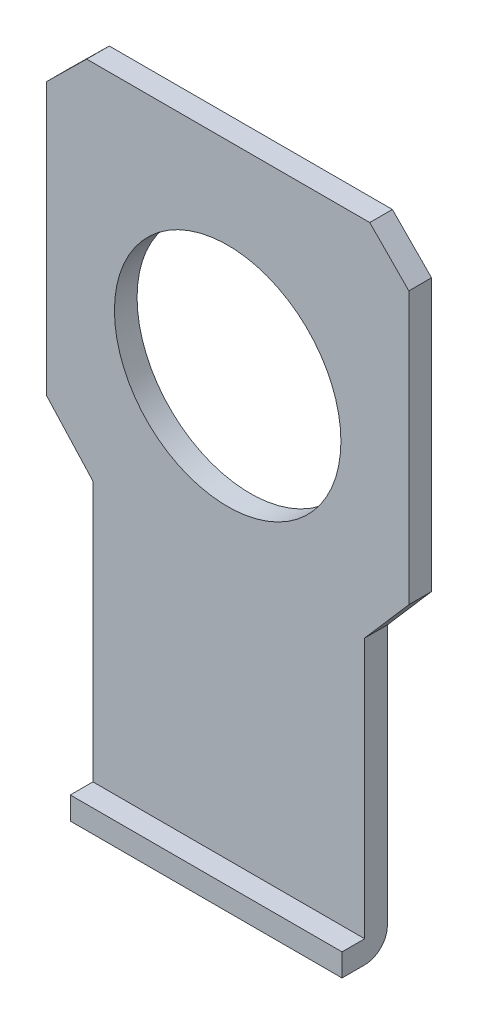
ISO-10303-21;
HEADER;
FILE_DESCRIPTION(('STEP AP214'),'2;1');
FILE_NAME('part.step','',(''),(''),'','','');
FILE_SCHEMA(('AUTOMOTIVE_DESIGN { 1 0 10303 214 1 1 1 1 }'));
ENDSEC;
DATA;
#1=APPLICATION_CONTEXT('core data for automotive mechanical design processes');
#2=APPLICATION_PROTOCOL_DEFINITION('international standard','automotive_design',2000,#1);
#3=PRODUCT_CONTEXT('',#1,'mechanical');
#4=PRODUCT('Part','Part','',(#3));
#5=PRODUCT_RELATED_PRODUCT_CATEGORY('part','',(#4));
#6=PRODUCT_DEFINITION_FORMATION('','',#4);
#7=PRODUCT_DEFINITION_CONTEXT('part definition',#1,'design');
#8=PRODUCT_DEFINITION('design','',#6,#7);
#9=PRODUCT_DEFINITION_SHAPE('','',#8);
#10=(LENGTH_UNIT() NAMED_UNIT(*) SI_UNIT(.MILLI.,.METRE.));
#11=(NAMED_UNIT(*) PLANE_ANGLE_UNIT() SI_UNIT($,.RADIAN.));
#12=(NAMED_UNIT(*) SI_UNIT($,.STERADIAN.) SOLID_ANGLE_UNIT());
#13=UNCERTAINTY_MEASURE_WITH_UNIT(LENGTH_MEASURE(1.E-05),#10,'distance_accuracy_value','');
#14=(GEOMETRIC_REPRESENTATION_CONTEXT(3) GLOBAL_UNCERTAINTY_ASSIGNED_CONTEXT((#13)) GLOBAL_UNIT_ASSIGNED_CONTEXT((#10,
#11,#12)) REPRESENTATION_CONTEXT('',''));
#15=CARTESIAN_POINT('',(0.,0.,0.));
#16=DIRECTION('',(0.,0.,1.));
#17=DIRECTION('',(1.,0.,0.));
#18=AXIS2_PLACEMENT_3D('',#15,#16,#17);
#19=CARTESIAN_POINT('',(-2.43,1.65,0.1));
#20=DIRECTION('',(-1.,0.,0.));
#21=DIRECTION('',(0.,0.,1.));
#22=AXIS2_PLACEMENT_3D('',#19,#20,#21);
#23=CYLINDRICAL_SURFACE('',#22,0.1);
#24=CARTESIAN_POINT('',(-2.225,1.65,0.1));
#25=DIRECTION('',(-1.,0.,0.));
#26=DIRECTION('',(0.,0.,1.));
#27=AXIS2_PLACEMENT_3D('',#24,#25,#26);
#28=CIRCLE('',#27,0.1);
#29=CARTESIAN_POINT('',(-2.225,1.65,0.));
#30=VERTEX_POINT('',#29);
#31=CARTESIAN_POINT('',(-2.225,1.55,0.1));
#32=VERTEX_POINT('',#31);
#33=EDGE_CURVE('E118',#30,#32,#28,.T.);
#34=ORIENTED_EDGE('',*,*,#33,.F.);
#35=DIRECTION('',(1.,0.,0.));
#36=VECTOR('',#35,1.);
#37=CARTESIAN_POINT('',(-2.43,1.65,0.));
#38=LINE('',#37,#36);
#39=CARTESIAN_POINT('',(-1.025,1.65,0.));
#40=VERTEX_POINT('',#39);
#41=EDGE_CURVE('E113',#30,#40,#38,.T.);
#42=ORIENTED_EDGE('',*,*,#41,.T.);
#43=CARTESIAN_POINT('',(-1.025,1.65,0.1));
#44=DIRECTION('',(-1.,0.,0.));
#45=DIRECTION('',(0.,0.,1.));
#46=AXIS2_PLACEMENT_3D('',#43,#44,#45);
#47=CIRCLE('',#46,0.1);
#48=CARTESIAN_POINT('',(-1.025,1.55,0.1));
#49=VERTEX_POINT('',#48);
#50=EDGE_CURVE('E19',#49,#40,#47,.F.);
#51=ORIENTED_EDGE('',*,*,#50,.F.);
#52=DIRECTION('',(1.,0.,0.));
#53=VECTOR('',#52,1.);
#54=CARTESIAN_POINT('',(-2.225,1.55,0.1));
#55=LINE('',#54,#53);
#56=EDGE_CURVE('E108',#32,#49,#55,.T.);
#57=ORIENTED_EDGE('',*,*,#56,.F.);
#58=EDGE_LOOP('',(#34,#42,#51,#57));
#59=FACE_BOUND('',#58,.T.);
#60=ADVANCED_FACE('F16',(#59),#23,.T.);
#61=CARTESIAN_POINT('',(-2.225,1.55,0.2));
#62=DIRECTION('',(0.,-1.,0.));
#63=DIRECTION('',(0.,0.,-1.));
#64=AXIS2_PLACEMENT_3D('',#61,#62,#63);
#65=PLANE('',#64);
#66=DIRECTION('',(0.,0.,-1.));
#67=VECTOR('',#66,1.);
#68=CARTESIAN_POINT('',(-1.025,1.55,0.));
#69=LINE('',#68,#67);
#70=CARTESIAN_POINT('',(-1.025,1.55,0.2));
#71=VERTEX_POINT('',#70);
#72=EDGE_CURVE('E137',#71,#49,#69,.T.);
#73=ORIENTED_EDGE('',*,*,#72,.F.);
#74=DIRECTION('',(-1.,0.,0.));
#75=VECTOR('',#74,1.);
#76=CARTESIAN_POINT('',(-2.225,1.55,0.2));
#77=LINE('',#76,#75);
#78=CARTESIAN_POINT('',(-2.225,1.55,0.2));
#79=VERTEX_POINT('',#78);
#80=EDGE_CURVE('E122',#71,#79,#77,.T.);
#81=ORIENTED_EDGE('',*,*,#80,.T.);
#82=DIRECTION('',(0.,0.,1.));
#83=VECTOR('',#82,1.);
#84=CARTESIAN_POINT('',(-2.225,1.55,0.));
#85=LINE('',#84,#83);
#86=EDGE_CURVE('E150',#32,#79,#85,.T.);
#87=ORIENTED_EDGE('',*,*,#86,.F.);
#88=ORIENTED_EDGE('',*,*,#56,.T.);
#89=EDGE_LOOP('',(#73,#81,#87,#88));
#90=FACE_BOUND('',#89,.T.);
#91=ADVANCED_FACE('F276',(#90),#65,.T.);
#92=CARTESIAN_POINT('',(-2.225,1.65,0.2));
#93=DIRECTION('',(0.,0.,-1.));
#94=DIRECTION('',(-1.,0.,0.));
#95=AXIS2_PLACEMENT_3D('',#92,#93,#94);
#96=PLANE('',#95);
#97=ORIENTED_EDGE('',*,*,#80,.F.);
#98=DIRECTION('',(0.,1.,0.));
#99=VECTOR('',#98,1.);
#100=CARTESIAN_POINT('',(-1.025,1.05,0.2));
#101=LINE('',#100,#99);
#102=CARTESIAN_POINT('',(-1.025,1.65,0.2));
#103=VERTEX_POINT('',#102);
#104=EDGE_CURVE('E244',#103,#71,#101,.F.);
#105=ORIENTED_EDGE('',*,*,#104,.F.);
#106=DIRECTION('',(1.,0.,0.));
#107=VECTOR('',#106,1.);
#108=CARTESIAN_POINT('',(-1.025,1.65,0.2));
#109=LINE('',#108,#107);
#110=CARTESIAN_POINT('',(-2.225,1.65,0.2));
#111=VERTEX_POINT('',#110);
#112=EDGE_CURVE('E121',#111,#103,#109,.T.);
#113=ORIENTED_EDGE('',*,*,#112,.F.);
#114=DIRECTION('',(0.,-1.,0.));
#115=VECTOR('',#114,1.);
#116=CARTESIAN_POINT('',(-2.225,2.8,0.2));
#117=LINE('',#116,#115);
#118=EDGE_CURVE('E146',#79,#111,#117,.F.);
#119=ORIENTED_EDGE('',*,*,#118,.F.);
#120=EDGE_LOOP('',(#97,#105,#113,#119));
#121=FACE_BOUND('',#120,.T.);
#122=ADVANCED_FACE('F275',(#121),#96,.F.);
#123=CARTESIAN_POINT('',(-2.43,-1.7,0.));
#124=DIRECTION('',(0.,0.,1.));
#125=DIRECTION('',(1.,0.,0.));
#126=AXIS2_PLACEMENT_3D('',#123,#124,#125);
#127=PLANE('',#126);
#128=ORIENTED_EDGE('',*,*,#41,.F.);
#129=DIRECTION('',(0.,-1.,0.));
#130=VECTOR('',#129,1.);
#131=CARTESIAN_POINT('',(-2.225,2.8,0.));
#132=LINE('',#131,#130);
#133=CARTESIAN_POINT('',(-2.225,2.8,0.));
#134=VERTEX_POINT('',#133);
#135=EDGE_CURVE('E158',#134,#30,#132,.T.);
#136=ORIENTED_EDGE('',*,*,#135,.F.);
#137=DIRECTION('',(0.673489996183713,-0.739196337274788,0.));
#138=VECTOR('',#137,1.);
#139=CARTESIAN_POINT('',(-2.43,3.025,0.));
#140=LINE('',#139,#138);
#141=CARTESIAN_POINT('',(-2.43,3.025,0.));
#142=VERTEX_POINT('',#141);
#143=EDGE_CURVE('E156',#142,#134,#140,.T.);
#144=ORIENTED_EDGE('',*,*,#143,.F.);
#145=DIRECTION('',(0.,1.,0.));
#146=VECTOR('',#145,1.);
#147=CARTESIAN_POINT('',(-2.43,4.4,0.));
#148=LINE('',#147,#146);
#149=CARTESIAN_POINT('',(-2.43,4.225,0.));
#150=VERTEX_POINT('',#149);
#151=EDGE_CURVE('E171',#142,#150,#148,.T.);
#152=ORIENTED_EDGE('',*,*,#151,.T.);
#153=DIRECTION('',(0.711773999328805,0.702408551969207,0.));
#154=VECTOR('',#153,1.);
#155=CARTESIAN_POINT('',(-2.43,4.225,0.));
#156=LINE('',#155,#154);
#157=CARTESIAN_POINT('',(-2.25266666666667,4.4,0.));
#158=VERTEX_POINT('',#157);
#159=EDGE_CURVE('E187',#150,#158,#156,.T.);
#160=ORIENTED_EDGE('',*,*,#159,.T.);
#161=DIRECTION('',(1.,0.,0.));
#162=VECTOR('',#161,1.);
#163=CARTESIAN_POINT('',(-2.25266666666667,4.4,0.));
#164=LINE('',#163,#162);
#165=CARTESIAN_POINT('',(-1.00266666666666,4.4,0.));
#166=VERTEX_POINT('',#165);
#167=EDGE_CURVE('E195',#158,#166,#164,.T.);
#168=ORIENTED_EDGE('',*,*,#167,.T.);
#169=DIRECTION('',(0.702345280394573,-0.711836432832338,0.));
#170=VECTOR('',#169,1.);
#171=CARTESIAN_POINT('',(-1.2,4.6,0.));
#172=LINE('',#171,#170);
#173=CARTESIAN_POINT('',(-0.83,4.225,0.));
#174=VERTEX_POINT('',#173);
#175=EDGE_CURVE('E197',#166,#174,#172,.T.);
#176=ORIENTED_EDGE('',*,*,#175,.T.);
#177=DIRECTION('',(0.,-1.,0.));
#178=VECTOR('',#177,1.);
#179=CARTESIAN_POINT('',(-0.83,4.4,0.));
#180=LINE('',#179,#178);
#181=CARTESIAN_POINT('',(-0.83,3.025,0.));
#182=VERTEX_POINT('',#181);
#183=EDGE_CURVE('E212',#174,#182,#180,.T.);
#184=ORIENTED_EDGE('',*,*,#183,.T.);
#185=DIRECTION('',(0.654930538417843,0.755689082789817,0.));
#186=VECTOR('',#185,1.);
#187=CARTESIAN_POINT('',(-1.025,2.8,0.));
#188=LINE('',#187,#186);
#189=CARTESIAN_POINT('',(-1.025,2.8,0.));
#190=VERTEX_POINT('',#189);
#191=EDGE_CURVE('E129',#190,#182,#188,.T.);
#192=ORIENTED_EDGE('',*,*,#191,.F.);
#193=DIRECTION('',(0.,1.,0.));
#194=VECTOR('',#193,1.);
#195=CARTESIAN_POINT('',(-1.025,1.05,0.));
#196=LINE('',#195,#194);
#197=EDGE_CURVE('E125',#40,#190,#196,.T.);
#198=ORIENTED_EDGE('',*,*,#197,.F.);
#199=EDGE_LOOP('',(#128,#136,#144,#152,#160,#168,#176,#184,#192,#198));
#200=FACE_BOUND('',#199,.T.);
#201=CARTESIAN_POINT('',(-1.63,3.5,0.));
#202=DIRECTION('',(0.,0.,-1.));
#203=DIRECTION('',(-1.,0.,0.));
#204=AXIS2_PLACEMENT_3D('',#201,#202,#203);
#205=CIRCLE('',#204,0.5);
#206=CARTESIAN_POINT('',(-2.13,3.5,0.));
#207=VERTEX_POINT('',#206);
#208=EDGE_CURVE('E163',#207,#207,#205,.F.);
#209=ORIENTED_EDGE('',*,*,#208,.T.);
#210=EDGE_LOOP('',(#209));
#211=FACE_BOUND('',#210,.T.);
#212=ADVANCED_FACE('F126',(#200,#211),#127,.F.);
#213=CARTESIAN_POINT('',(-1.025,1.65,0.2));
#214=DIRECTION('',(0.,1.,0.));
#215=DIRECTION('',(0.,0.,1.));
#216=AXIS2_PLACEMENT_3D('',#213,#214,#215);
#217=PLANE('',#216);
#218=DIRECTION('',(0.,0.,1.));
#219=VECTOR('',#218,1.);
#220=CARTESIAN_POINT('',(-2.225,1.65,0.));
#221=LINE('',#220,#219);
#222=CARTESIAN_POINT('',(-2.225,1.65,0.1));
#223=VERTEX_POINT('',#222);
#224=EDGE_CURVE('E149',#111,#223,#221,.F.);
#225=ORIENTED_EDGE('',*,*,#224,.F.);
#226=ORIENTED_EDGE('',*,*,#112,.T.);
#227=DIRECTION('',(0.,0.,-1.));
#228=VECTOR('',#227,1.);
#229=CARTESIAN_POINT('',(-1.025,1.65,0.));
#230=LINE('',#229,#228);
#231=CARTESIAN_POINT('',(-1.025,1.65,0.1));
#232=VERTEX_POINT('',#231);
#233=EDGE_CURVE('E132',#232,#103,#230,.F.);
#234=ORIENTED_EDGE('',*,*,#233,.F.);
#235=DIRECTION('',(1.,0.,0.));
#236=VECTOR('',#235,1.);
#237=CARTESIAN_POINT('',(-2.43,1.65,0.1));
#238=LINE('',#237,#236);
#239=EDGE_CURVE('E249',#223,#232,#238,.T.);
#240=ORIENTED_EDGE('',*,*,#239,.F.);
#241=EDGE_LOOP('',(#225,#226,#234,#240));
#242=FACE_BOUND('',#241,.T.);
#243=ADVANCED_FACE('F270',(#242),#217,.T.);
#244=CARTESIAN_POINT('',(-1.025,1.05,0.));
#245=DIRECTION('',(1.,0.,0.));
#246=DIRECTION('',(0.,0.,-1.));
#247=AXIS2_PLACEMENT_3D('',#244,#245,#246);
#248=PLANE('',#247);
#249=ORIENTED_EDGE('',*,*,#233,.T.);
#250=ORIENTED_EDGE('',*,*,#104,.T.);
#251=ORIENTED_EDGE('',*,*,#72,.T.);
#252=ORIENTED_EDGE('',*,*,#50,.T.);
#253=ORIENTED_EDGE('',*,*,#197,.T.);
#254=DIRECTION('',(0.,0.,1.));
#255=VECTOR('',#254,1.);
#256=CARTESIAN_POINT('',(-1.025,2.8,0.));
#257=LINE('',#256,#255);
#258=CARTESIAN_POINT('',(-1.025,2.8,0.1));
#259=VERTEX_POINT('',#258);
#260=EDGE_CURVE('E235',#259,#190,#257,.F.);
#261=ORIENTED_EDGE('',*,*,#260,.F.);
#262=DIRECTION('',(0.,1.,0.));
#263=VECTOR('',#262,1.);
#264=CARTESIAN_POINT('',(-1.025,-1.7,0.1));
#265=LINE('',#264,#263);
#266=EDGE_CURVE('E240',#232,#259,#265,.T.);
#267=ORIENTED_EDGE('',*,*,#266,.F.);
#268=EDGE_LOOP('',(#249,#250,#251,#252,#253,#261,#267));
#269=FACE_BOUND('',#268,.T.);
#270=ADVANCED_FACE('F135',(#269),#248,.T.);
#271=CARTESIAN_POINT('',(-1.025,2.8,0.));
#272=DIRECTION('',(0.755689082789817,-0.654930538417843,0.));
#273=DIRECTION('',(0.654930538417843,0.755689082789817,0.));
#274=AXIS2_PLACEMENT_3D('',#271,#272,#273);
#275=PLANE('',#274);
#276=ORIENTED_EDGE('',*,*,#191,.T.);
#277=DIRECTION('',(0.,0.,1.));
#278=VECTOR('',#277,1.);
#279=CARTESIAN_POINT('',(-0.83,3.025,0.));
#280=LINE('',#279,#278);
#281=CARTESIAN_POINT('',(-0.83,3.025,0.1));
#282=VERTEX_POINT('',#281);
#283=EDGE_CURVE('E216',#182,#282,#280,.T.);
#284=ORIENTED_EDGE('',*,*,#283,.T.);
#285=DIRECTION('',(0.654930538417841,0.755689082789818,0.));
#286=VECTOR('',#285,1.);
#287=CARTESIAN_POINT('',(-1.025,2.8,0.1));
#288=LINE('',#287,#286);
#289=EDGE_CURVE('E228',#259,#282,#288,.T.);
#290=ORIENTED_EDGE('',*,*,#289,.F.);
#291=ORIENTED_EDGE('',*,*,#260,.T.);
#292=EDGE_LOOP('',(#276,#284,#290,#291));
#293=FACE_BOUND('',#292,.T.);
#294=ADVANCED_FACE('F377',(#293),#275,.T.);
#295=CARTESIAN_POINT('',(-0.83,4.4,0.));
#296=DIRECTION('',(-1.,0.,0.));
#297=DIRECTION('',(0.,-1.,0.));
#298=AXIS2_PLACEMENT_3D('',#295,#296,#297);
#299=PLANE('',#298);
#300=DIRECTION('',(0.,0.,1.));
#301=VECTOR('',#300,1.);
#302=CARTESIAN_POINT('',(-0.83,4.225,0.));
#303=LINE('',#302,#301);
#304=CARTESIAN_POINT('',(-0.83,4.225,0.1));
#305=VERTEX_POINT('',#304);
#306=EDGE_CURVE('E205',#174,#305,#303,.T.);
#307=ORIENTED_EDGE('',*,*,#306,.T.);
#308=DIRECTION('',(0.,1.,0.));
#309=VECTOR('',#308,1.);
#310=CARTESIAN_POINT('',(-0.83,-1.7,0.1));
#311=LINE('',#310,#309);
#312=EDGE_CURVE('E223',#282,#305,#311,.T.);
#313=ORIENTED_EDGE('',*,*,#312,.F.);
#314=ORIENTED_EDGE('',*,*,#283,.F.);
#315=ORIENTED_EDGE('',*,*,#183,.F.);
#316=EDGE_LOOP('',(#307,#313,#314,#315));
#317=FACE_BOUND('',#316,.T.);
#318=ADVANCED_FACE('F385',(#317),#299,.F.);
#319=CARTESIAN_POINT('',(-1.2,4.6,0.));
#320=DIRECTION('',(-0.711836432832338,-0.702345280394573,0.));
#321=DIRECTION('',(0.702345280394573,-0.711836432832338,0.));
#322=AXIS2_PLACEMENT_3D('',#319,#320,#321);
#323=PLANE('',#322);
#324=DIRECTION('',(0.,0.,-1.));
#325=VECTOR('',#324,1.);
#326=CARTESIAN_POINT('',(-1.00266666666666,4.4,0.));
#327=LINE('',#326,#325);
#328=CARTESIAN_POINT('',(-1.00266666666666,4.4,0.1));
#329=VERTEX_POINT('',#328);
#330=EDGE_CURVE('E189',#166,#329,#327,.F.);
#331=ORIENTED_EDGE('',*,*,#330,.T.);
#332=DIRECTION('',(-0.702345280394558,0.711836432832353,0.));
#333=VECTOR('',#332,1.);
#334=CARTESIAN_POINT('',(-0.83,4.225,0.1));
#335=LINE('',#334,#333);
#336=EDGE_CURVE('E219',#305,#329,#335,.T.);
#337=ORIENTED_EDGE('',*,*,#336,.F.);
#338=ORIENTED_EDGE('',*,*,#306,.F.);
#339=ORIENTED_EDGE('',*,*,#175,.F.);
#340=EDGE_LOOP('',(#331,#337,#338,#339));
#341=FACE_BOUND('',#340,.T.);
#342=ADVANCED_FACE('F395',(#341),#323,.F.);
#343=CARTESIAN_POINT('',(-2.25266666666667,4.4,0.));
#344=DIRECTION('',(0.,-1.,0.));
#345=DIRECTION('',(0.,0.,-1.));
#346=AXIS2_PLACEMENT_3D('',#343,#344,#345);
#347=PLANE('',#346);
#348=ORIENTED_EDGE('',*,*,#330,.F.);
#349=ORIENTED_EDGE('',*,*,#167,.F.);
#350=DIRECTION('',(0.,0.,1.));
#351=VECTOR('',#350,1.);
#352=CARTESIAN_POINT('',(-2.25266666666667,4.4,0.));
#353=LINE('',#352,#351);
#354=CARTESIAN_POINT('',(-2.25266666666667,4.4,0.1));
#355=VERTEX_POINT('',#354);
#356=EDGE_CURVE('E173',#158,#355,#353,.T.);
#357=ORIENTED_EDGE('',*,*,#356,.T.);
#358=DIRECTION('',(1.,0.,0.));
#359=VECTOR('',#358,1.);
#360=CARTESIAN_POINT('',(-2.43,4.4,0.1));
#361=LINE('',#360,#359);
#362=EDGE_CURVE('E222',#329,#355,#361,.F.);
#363=ORIENTED_EDGE('',*,*,#362,.F.);
#364=EDGE_LOOP('',(#348,#349,#357,#363));
#365=FACE_BOUND('',#364,.T.);
#366=ADVANCED_FACE('F293',(#365),#347,.F.);
#367=CARTESIAN_POINT('',(-2.43,4.225,0.));
#368=DIRECTION('',(0.702408551969207,-0.711773999328805,0.));
#369=DIRECTION('',(0.711773999328805,0.702408551969207,0.));
#370=AXIS2_PLACEMENT_3D('',#367,#368,#369);
#371=PLANE('',#370);
#372=ORIENTED_EDGE('',*,*,#356,.F.);
#373=ORIENTED_EDGE('',*,*,#159,.F.);
#374=DIRECTION('',(0.,0.,1.));
#375=VECTOR('',#374,1.);
#376=CARTESIAN_POINT('',(-2.43,4.225,0.1));
#377=LINE('',#376,#375);
#378=CARTESIAN_POINT('',(-2.43,4.225,0.1));
#379=VERTEX_POINT('',#378);
#380=EDGE_CURVE('E168',#150,#379,#377,.T.);
#381=ORIENTED_EDGE('',*,*,#380,.T.);
#382=DIRECTION('',(-0.711773999328793,-0.702408551969219,0.));
#383=VECTOR('',#382,1.);
#384=CARTESIAN_POINT('',(-2.25266666666667,4.4,0.1));
#385=LINE('',#384,#383);
#386=EDGE_CURVE('E184',#355,#379,#385,.T.);
#387=ORIENTED_EDGE('',*,*,#386,.F.);
#388=EDGE_LOOP('',(#372,#373,#381,#387));
#389=FACE_BOUND('',#388,.T.);
#390=ADVANCED_FACE('F298',(#389),#371,.F.);
#391=CARTESIAN_POINT('',(-2.43,4.4,0.1));
#392=DIRECTION('',(1.,0.,0.));
#393=DIRECTION('',(0.,1.,0.));
#394=AXIS2_PLACEMENT_3D('',#391,#392,#393);
#395=PLANE('',#394);
#396=ORIENTED_EDGE('',*,*,#380,.F.);
#397=ORIENTED_EDGE('',*,*,#151,.F.);
#398=DIRECTION('',(0.,0.,1.));
#399=VECTOR('',#398,1.);
#400=CARTESIAN_POINT('',(-2.43,3.025,0.));
#401=LINE('',#400,#399);
#402=CARTESIAN_POINT('',(-2.43,3.025,0.1));
#403=VERTEX_POINT('',#402);
#404=EDGE_CURVE('E159',#403,#142,#401,.F.);
#405=ORIENTED_EDGE('',*,*,#404,.F.);
#406=DIRECTION('',(0.,1.,0.));
#407=VECTOR('',#406,1.);
#408=CARTESIAN_POINT('',(-2.43,-1.7,0.1));
#409=LINE('',#408,#407);
#410=EDGE_CURVE('E179',#379,#403,#409,.F.);
#411=ORIENTED_EDGE('',*,*,#410,.F.);
#412=EDGE_LOOP('',(#396,#397,#405,#411));
#413=FACE_BOUND('',#412,.T.);
#414=ADVANCED_FACE('F302',(#413),#395,.F.);
#415=CARTESIAN_POINT('',(-2.43,3.025,0.));
#416=DIRECTION('',(-0.739196337274788,-0.673489996183713,0.));
#417=DIRECTION('',(0.673489996183713,-0.739196337274788,0.));
#418=AXIS2_PLACEMENT_3D('',#415,#416,#417);
#419=PLANE('',#418);
#420=ORIENTED_EDGE('',*,*,#143,.T.);
#421=DIRECTION('',(0.,0.,1.));
#422=VECTOR('',#421,1.);
#423=CARTESIAN_POINT('',(-2.225,2.8,0.));
#424=LINE('',#423,#422);
#425=CARTESIAN_POINT('',(-2.225,2.8,0.1));
#426=VERTEX_POINT('',#425);
#427=EDGE_CURVE('E34',#426,#134,#424,.F.);
#428=ORIENTED_EDGE('',*,*,#427,.F.);
#429=DIRECTION('',(0.673489996183704,-0.739196337274797,0.));
#430=VECTOR('',#429,1.);
#431=CARTESIAN_POINT('',(-2.43,3.025,0.1));
#432=LINE('',#431,#430);
#433=EDGE_CURVE('E176',#403,#426,#432,.T.);
#434=ORIENTED_EDGE('',*,*,#433,.F.);
#435=ORIENTED_EDGE('',*,*,#404,.T.);
#436=EDGE_LOOP('',(#420,#428,#434,#435));
#437=FACE_BOUND('',#436,.T.);
#438=ADVANCED_FACE('F304',(#437),#419,.T.);
#439=CARTESIAN_POINT('',(-2.225,2.8,0.));
#440=DIRECTION('',(-1.,0.,0.));
#441=DIRECTION('',(0.,-1.,0.));
#442=AXIS2_PLACEMENT_3D('',#439,#440,#441);
#443=PLANE('',#442);
#444=DIRECTION('',(0.,1.,0.));
#445=VECTOR('',#444,1.);
#446=CARTESIAN_POINT('',(-2.225,-1.7,0.1));
#447=LINE('',#446,#445);
#448=EDGE_CURVE('E25',#426,#223,#447,.F.);
#449=ORIENTED_EDGE('',*,*,#448,.F.);
#450=ORIENTED_EDGE('',*,*,#427,.T.);
#451=ORIENTED_EDGE('',*,*,#135,.T.);
#452=ORIENTED_EDGE('',*,*,#33,.T.);
#453=ORIENTED_EDGE('',*,*,#86,.T.);
#454=ORIENTED_EDGE('',*,*,#118,.T.);
#455=ORIENTED_EDGE('',*,*,#224,.T.);
#456=EDGE_LOOP('',(#449,#450,#451,#452,#453,#454,#455));
#457=FACE_BOUND('',#456,.T.);
#458=ADVANCED_FACE('F277',(#457),#443,.T.);
#459=CARTESIAN_POINT('',(-1.63,3.5,-3.075));
#460=DIRECTION('',(0.,0.,-1.));
#461=DIRECTION('',(-1.,0.,0.));
#462=AXIS2_PLACEMENT_3D('',#459,#460,#461);
#463=CYLINDRICAL_SURFACE('',#462,0.5);
#464=ORIENTED_EDGE('',*,*,#208,.F.);
#465=EDGE_LOOP('',(#464));
#466=FACE_BOUND('',#465,.T.);
#467=CARTESIAN_POINT('',(-1.63,3.5,0.0999999999999998));
#468=DIRECTION('',(0.,0.,-1.));
#469=DIRECTION('',(-1.,0.,0.));
#470=AXIS2_PLACEMENT_3D('',#467,#468,#469);
#471=CIRCLE('',#470,0.5);
#472=CARTESIAN_POINT('',(-2.13,3.5,0.0999999999999998));
#473=VERTEX_POINT('',#472);
#474=EDGE_CURVE('E11',#473,#473,#471,.T.);
#475=ORIENTED_EDGE('',*,*,#474,.F.);
#476=EDGE_LOOP('',(#475));
#477=FACE_BOUND('',#476,.T.);
#478=ADVANCED_FACE('F312',(#466,#477),#463,.F.);
#479=CARTESIAN_POINT('',(-2.43,-1.7,0.1));
#480=DIRECTION('',(0.,0.,1.));
#481=DIRECTION('',(1.,0.,0.));
#482=AXIS2_PLACEMENT_3D('',#479,#480,#481);
#483=PLANE('',#482);
#484=ORIENTED_EDGE('',*,*,#474,.T.);
#485=EDGE_LOOP('',(#484));
#486=FACE_BOUND('',#485,.T.);
#487=ORIENTED_EDGE('',*,*,#433,.T.);
#488=ORIENTED_EDGE('',*,*,#448,.T.);
#489=ORIENTED_EDGE('',*,*,#239,.T.);
#490=ORIENTED_EDGE('',*,*,#266,.T.);
#491=ORIENTED_EDGE('',*,*,#289,.T.);
#492=ORIENTED_EDGE('',*,*,#312,.T.);
#493=ORIENTED_EDGE('',*,*,#336,.T.);
#494=ORIENTED_EDGE('',*,*,#362,.T.);
#495=ORIENTED_EDGE('',*,*,#386,.T.);
#496=ORIENTED_EDGE('',*,*,#410,.T.);
#497=EDGE_LOOP('',(#487,#488,#489,#490,#491,#492,#493,#494,#495,#496));
#498=FACE_BOUND('',#497,.T.);
#499=ADVANCED_FACE('F281',(#486,#498),#483,.T.);
#500=CLOSED_SHELL('',(#60,#91,#122,#212,#243,#270,#294,#318,#342,#366,#390,#414,#438,#458,#478,#499));
#501=MANIFOLD_SOLID_BREP('B1',#500);
#502=ADVANCED_BREP_SHAPE_REPRESENTATION('',(#18,#501),#14);
#503=SHAPE_DEFINITION_REPRESENTATION(#9,#502);
ENDSEC;
END-ISO-10303-21;
